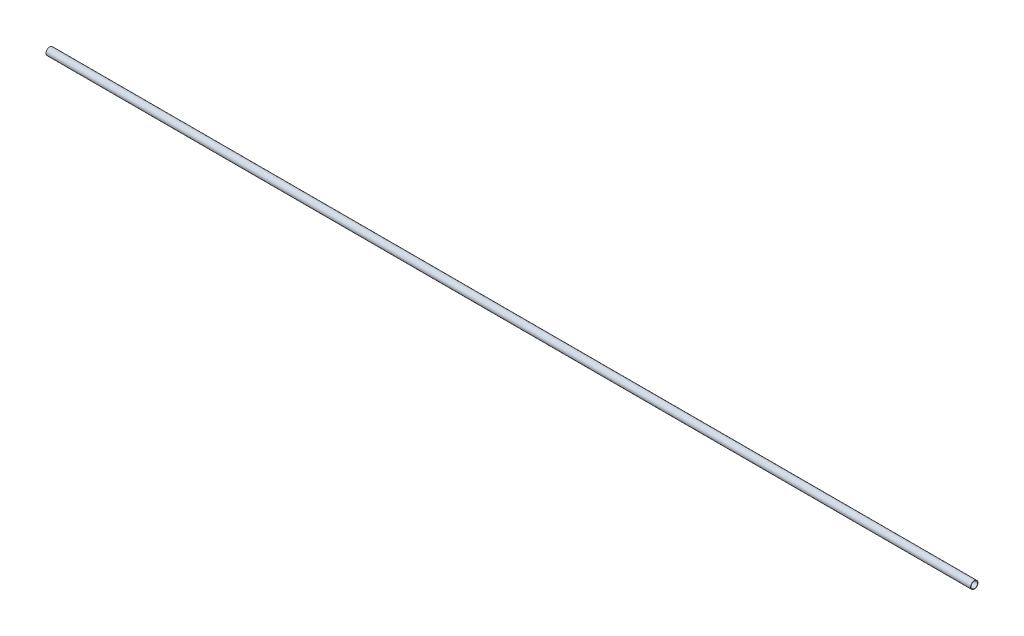
ISO-10303-21;
HEADER;
FILE_DESCRIPTION(('STEP AP214'),'2;1');
FILE_NAME('part.step','',(''),(''),'','','');
FILE_SCHEMA(('AUTOMOTIVE_DESIGN { 1 0 10303 214 1 1 1 1 }'));
ENDSEC;
DATA;
#1=APPLICATION_CONTEXT('core data for automotive mechanical design processes');
#2=APPLICATION_PROTOCOL_DEFINITION('international standard','automotive_design',2000,#1);
#3=PRODUCT_CONTEXT('',#1,'mechanical');
#4=PRODUCT('Part','Part','',(#3));
#5=PRODUCT_RELATED_PRODUCT_CATEGORY('part','',(#4));
#6=PRODUCT_DEFINITION_FORMATION('','',#4);
#7=PRODUCT_DEFINITION_CONTEXT('part definition',#1,'design');
#8=PRODUCT_DEFINITION('design','',#6,#7);
#9=PRODUCT_DEFINITION_SHAPE('','',#8);
#10=(LENGTH_UNIT() NAMED_UNIT(*) SI_UNIT(.MILLI.,.METRE.));
#11=(NAMED_UNIT(*) PLANE_ANGLE_UNIT() SI_UNIT($,.RADIAN.));
#12=(NAMED_UNIT(*) SI_UNIT($,.STERADIAN.) SOLID_ANGLE_UNIT());
#13=UNCERTAINTY_MEASURE_WITH_UNIT(LENGTH_MEASURE(1.E-05),#10,'distance_accuracy_value','');
#14=(GEOMETRIC_REPRESENTATION_CONTEXT(3) GLOBAL_UNCERTAINTY_ASSIGNED_CONTEXT((#13)) GLOBAL_UNIT_ASSIGNED_CONTEXT((#10,
#11,#12)) REPRESENTATION_CONTEXT('',''));
#15=CARTESIAN_POINT('',(0.,0.,0.));
#16=DIRECTION('',(0.,0.,1.));
#17=DIRECTION('',(1.,0.,0.));
#18=AXIS2_PLACEMENT_3D('',#15,#16,#17);
#19=CARTESIAN_POINT('',(0.,0.,0.));
#20=DIRECTION('',(1.,0.,0.));
#21=DIRECTION('',(0.,0.,-1.));
#22=AXIS2_PLACEMENT_3D('',#19,#20,#21);
#23=CYLINDRICAL_SURFACE('',#22,17.6);
#24=CARTESIAN_POINT('',(0.,0.,0.));
#25=DIRECTION('',(1.,0.,0.));
#26=DIRECTION('',(0.,0.,-1.));
#27=AXIS2_PLACEMENT_3D('',#24,#25,#26);
#28=CIRCLE('',#27,17.6);
#29=CARTESIAN_POINT('',(0.,0.,-17.6));
#30=VERTEX_POINT('',#29);
#31=EDGE_CURVE('E16',#30,#30,#28,.T.);
#32=ORIENTED_EDGE('',*,*,#31,.F.);
#33=EDGE_LOOP('',(#32));
#34=FACE_BOUND('',#33,.T.);
#35=CARTESIAN_POINT('',(5000.,0.,0.));
#36=DIRECTION('',(1.,0.,0.));
#37=DIRECTION('',(0.,0.,-1.));
#38=AXIS2_PLACEMENT_3D('',#35,#36,#37);
#39=CIRCLE('',#38,17.6);
#40=CARTESIAN_POINT('',(5000.,0.,-17.6));
#41=VERTEX_POINT('',#40);
#42=EDGE_CURVE('E25',#41,#41,#39,.F.);
#43=ORIENTED_EDGE('',*,*,#42,.F.);
#44=EDGE_LOOP('',(#43));
#45=FACE_BOUND('',#44,.T.);
#46=ADVANCED_FACE('F13',(#34,#45),#23,.F.);
#47=CARTESIAN_POINT('',(0.,-20.2400021082657,-20.));
#48=DIRECTION('',(-1.,0.,0.));
#49=DIRECTION('',(0.,0.,1.));
#50=AXIS2_PLACEMENT_3D('',#47,#48,#49);
#51=PLANE('',#50);
#52=ORIENTED_EDGE('',*,*,#31,.T.);
#53=EDGE_LOOP('',(#52));
#54=FACE_BOUND('',#53,.T.);
#55=CARTESIAN_POINT('',(0.,0.,0.));
#56=DIRECTION('',(1.,0.,0.));
#57=DIRECTION('',(0.,0.,-1.));
#58=AXIS2_PLACEMENT_3D('',#55,#56,#57);
#59=CIRCLE('',#58,20.);
#60=CARTESIAN_POINT('',(0.,0.,-20.));
#61=VERTEX_POINT('',#60);
#62=EDGE_CURVE('E20',#61,#61,#59,.T.);
#63=ORIENTED_EDGE('',*,*,#62,.F.);
#64=EDGE_LOOP('',(#63));
#65=FACE_BOUND('',#64,.T.);
#66=ADVANCED_FACE('F33',(#54,#65),#51,.T.);
#67=CARTESIAN_POINT('',(5000.,-20.2400021082657,20.));
#68=DIRECTION('',(1.,0.,0.));
#69=DIRECTION('',(0.,0.,-1.));
#70=AXIS2_PLACEMENT_3D('',#67,#68,#69);
#71=PLANE('',#70);
#72=ORIENTED_EDGE('',*,*,#42,.T.);
#73=EDGE_LOOP('',(#72));
#74=FACE_BOUND('',#73,.T.);
#75=CARTESIAN_POINT('',(5000.,0.,0.));
#76=DIRECTION('',(1.,0.,0.));
#77=DIRECTION('',(0.,0.,-1.));
#78=AXIS2_PLACEMENT_3D('',#75,#76,#77);
#79=CIRCLE('',#78,20.);
#80=CARTESIAN_POINT('',(5000.,0.,-20.));
#81=VERTEX_POINT('',#80);
#82=EDGE_CURVE('E8',#81,#81,#79,.F.);
#83=ORIENTED_EDGE('',*,*,#82,.F.);
#84=EDGE_LOOP('',(#83));
#85=FACE_BOUND('',#84,.T.);
#86=ADVANCED_FACE('F42',(#74,#85),#71,.T.);
#87=CARTESIAN_POINT('',(5000.,0.,0.));
#88=DIRECTION('',(1.,0.,0.));
#89=DIRECTION('',(0.,0.,-1.));
#90=AXIS2_PLACEMENT_3D('',#87,#88,#89);
#91=CYLINDRICAL_SURFACE('',#90,20.);
#92=ORIENTED_EDGE('',*,*,#62,.T.);
#93=EDGE_LOOP('',(#92));
#94=FACE_BOUND('',#93,.T.);
#95=ORIENTED_EDGE('',*,*,#82,.T.);
#96=EDGE_LOOP('',(#95));
#97=FACE_BOUND('',#96,.T.);
#98=ADVANCED_FACE('F43',(#94,#97),#91,.T.);
#99=CLOSED_SHELL('',(#46,#66,#86,#98));
#100=MANIFOLD_SOLID_BREP('B1',#99);
#101=ADVANCED_BREP_SHAPE_REPRESENTATION('',(#18,#100),#14);
#102=SHAPE_DEFINITION_REPRESENTATION(#9,#101);
ENDSEC;
END-ISO-10303-21;
